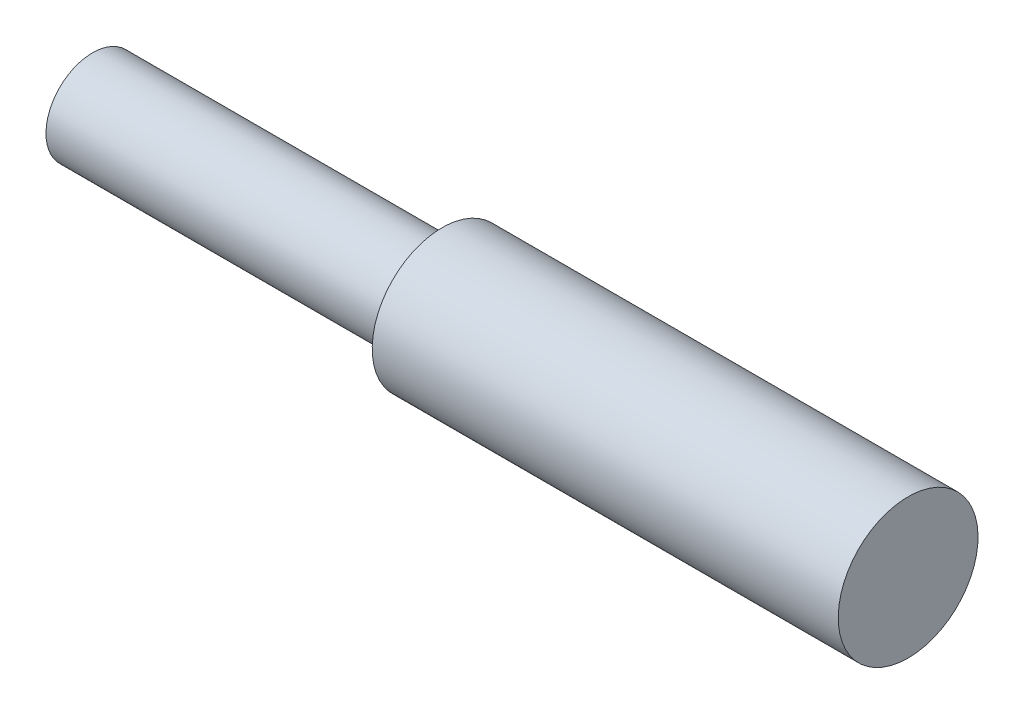
ISO-10303-21;
HEADER;
FILE_DESCRIPTION(('STEP AP214'),'2;1');
FILE_NAME('part.step','',(''),(''),'','','');
FILE_SCHEMA(('AUTOMOTIVE_DESIGN { 1 0 10303 214 1 1 1 1 }'));
ENDSEC;
DATA;
#1=APPLICATION_CONTEXT('core data for automotive mechanical design processes');
#2=APPLICATION_PROTOCOL_DEFINITION('international standard','automotive_design',2000,#1);
#3=PRODUCT_CONTEXT('',#1,'mechanical');
#4=PRODUCT('Part','Part','',(#3));
#5=PRODUCT_RELATED_PRODUCT_CATEGORY('part','',(#4));
#6=PRODUCT_DEFINITION_FORMATION('','',#4);
#7=PRODUCT_DEFINITION_CONTEXT('part definition',#1,'design');
#8=PRODUCT_DEFINITION('design','',#6,#7);
#9=PRODUCT_DEFINITION_SHAPE('','',#8);
#10=(LENGTH_UNIT() NAMED_UNIT(*) SI_UNIT(.MILLI.,.METRE.));
#11=(NAMED_UNIT(*) PLANE_ANGLE_UNIT() SI_UNIT($,.RADIAN.));
#12=(NAMED_UNIT(*) SI_UNIT($,.STERADIAN.) SOLID_ANGLE_UNIT());
#13=UNCERTAINTY_MEASURE_WITH_UNIT(LENGTH_MEASURE(1.E-05),#10,'distance_accuracy_value','');
#14=(GEOMETRIC_REPRESENTATION_CONTEXT(3) GLOBAL_UNCERTAINTY_ASSIGNED_CONTEXT((#13)) GLOBAL_UNIT_ASSIGNED_CONTEXT((#10,
#11,#12)) REPRESENTATION_CONTEXT('',''));
#15=CARTESIAN_POINT('',(0.,0.,0.));
#16=DIRECTION('',(0.,0.,1.));
#17=DIRECTION('',(1.,0.,0.));
#18=AXIS2_PLACEMENT_3D('',#15,#16,#17);
#19=CARTESIAN_POINT('',(20.,0.,0.));
#20=DIRECTION('',(-1.,0.,0.));
#21=DIRECTION('',(0.,-1.,0.));
#22=AXIS2_PLACEMENT_3D('',#19,#20,#21);
#23=CYLINDRICAL_SURFACE('',#22,3.);
#24=CARTESIAN_POINT('',(20.,0.,0.));
#25=DIRECTION('',(-1.,0.,0.));
#26=DIRECTION('',(0.,-1.,0.));
#27=AXIS2_PLACEMENT_3D('',#24,#25,#26);
#28=CIRCLE('',#27,3.);
#29=CARTESIAN_POINT('',(20.,-3.,0.));
#30=VERTEX_POINT('',#29);
#31=EDGE_CURVE('E10',#30,#30,#28,.T.);
#32=ORIENTED_EDGE('',*,*,#31,.T.);
#33=EDGE_LOOP('',(#32));
#34=FACE_BOUND('',#33,.T.);
#35=CARTESIAN_POINT('',(0.,0.,0.));
#36=DIRECTION('',(-1.,0.,0.));
#37=DIRECTION('',(0.,-1.,0.));
#38=AXIS2_PLACEMENT_3D('',#35,#36,#37);
#39=CIRCLE('',#38,3.);
#40=CARTESIAN_POINT('',(0.,-3.00000000000001,0.));
#41=VERTEX_POINT('',#40);
#42=EDGE_CURVE('E44',#41,#41,#39,.T.);
#43=ORIENTED_EDGE('',*,*,#42,.F.);
#44=EDGE_LOOP('',(#43));
#45=FACE_BOUND('',#44,.T.);
#46=ADVANCED_FACE('F30',(#34,#45),#23,.T.);
#47=CARTESIAN_POINT('',(20.,3.,0.));
#48=DIRECTION('',(1.,0.,0.));
#49=DIRECTION('',(0.,1.,0.));
#50=AXIS2_PLACEMENT_3D('',#47,#48,#49);
#51=PLANE('',#50);
#52=ORIENTED_EDGE('',*,*,#31,.F.);
#53=EDGE_LOOP('',(#52));
#54=FACE_BOUND('',#53,.T.);
#55=ADVANCED_FACE('F54',(#54),#51,.T.);
#56=CARTESIAN_POINT('',(-15.,0.,0.));
#57=DIRECTION('',(-1.,0.,0.));
#58=DIRECTION('',(0.,-1.,0.));
#59=AXIS2_PLACEMENT_3D('',#56,#57,#58);
#60=PLANE('',#59);
#61=CARTESIAN_POINT('',(-15.,0.,0.));
#62=DIRECTION('',(-1.,0.,0.));
#63=DIRECTION('',(0.,-1.,0.));
#64=AXIS2_PLACEMENT_3D('',#61,#62,#63);
#65=CIRCLE('',#64,2.00000000000002);
#66=CARTESIAN_POINT('',(-15.,-2.00000000000004,0.));
#67=VERTEX_POINT('',#66);
#68=EDGE_CURVE('E36',#67,#67,#65,.T.);
#69=ORIENTED_EDGE('',*,*,#68,.T.);
#70=EDGE_LOOP('',(#69));
#71=FACE_BOUND('',#70,.T.);
#72=ADVANCED_FACE('F58',(#71),#60,.T.);
#73=CARTESIAN_POINT('',(20.,0.,0.));
#74=DIRECTION('',(-1.,0.,0.));
#75=DIRECTION('',(0.,-1.,0.));
#76=AXIS2_PLACEMENT_3D('',#73,#74,#75);
#77=CYLINDRICAL_SURFACE('',#76,2.00000000000001);
#78=CARTESIAN_POINT('',(0.,0.,0.));
#79=DIRECTION('',(-1.,0.,0.));
#80=DIRECTION('',(0.,-1.,0.));
#81=AXIS2_PLACEMENT_3D('',#78,#79,#80);
#82=CIRCLE('',#81,2.00000000000001);
#83=CARTESIAN_POINT('',(0.,-2.00000000000002,0.));
#84=VERTEX_POINT('',#83);
#85=EDGE_CURVE('E40',#84,#84,#82,.T.);
#86=ORIENTED_EDGE('',*,*,#85,.T.);
#87=EDGE_LOOP('',(#86));
#88=FACE_BOUND('',#87,.T.);
#89=ORIENTED_EDGE('',*,*,#68,.F.);
#90=EDGE_LOOP('',(#89));
#91=FACE_BOUND('',#90,.T.);
#92=ADVANCED_FACE('F63',(#88,#91),#77,.T.);
#93=CARTESIAN_POINT('',(0.,1.99999999999999,0.));
#94=DIRECTION('',(-1.,0.,0.));
#95=DIRECTION('',(0.,-1.,0.));
#96=AXIS2_PLACEMENT_3D('',#93,#94,#95);
#97=PLANE('',#96);
#98=ORIENTED_EDGE('',*,*,#42,.T.);
#99=EDGE_LOOP('',(#98));
#100=FACE_BOUND('',#99,.T.);
#101=ORIENTED_EDGE('',*,*,#85,.F.);
#102=EDGE_LOOP('',(#101));
#103=FACE_BOUND('',#102,.T.);
#104=ADVANCED_FACE('F50',(#100,#103),#97,.T.);
#105=CLOSED_SHELL('',(#46,#55,#72,#92,#104));
#106=MANIFOLD_SOLID_BREP('B2',#105);
#107=ADVANCED_BREP_SHAPE_REPRESENTATION('',(#18,#106),#14);
#108=SHAPE_DEFINITION_REPRESENTATION(#9,#107);
ENDSEC;
END-ISO-10303-21;
